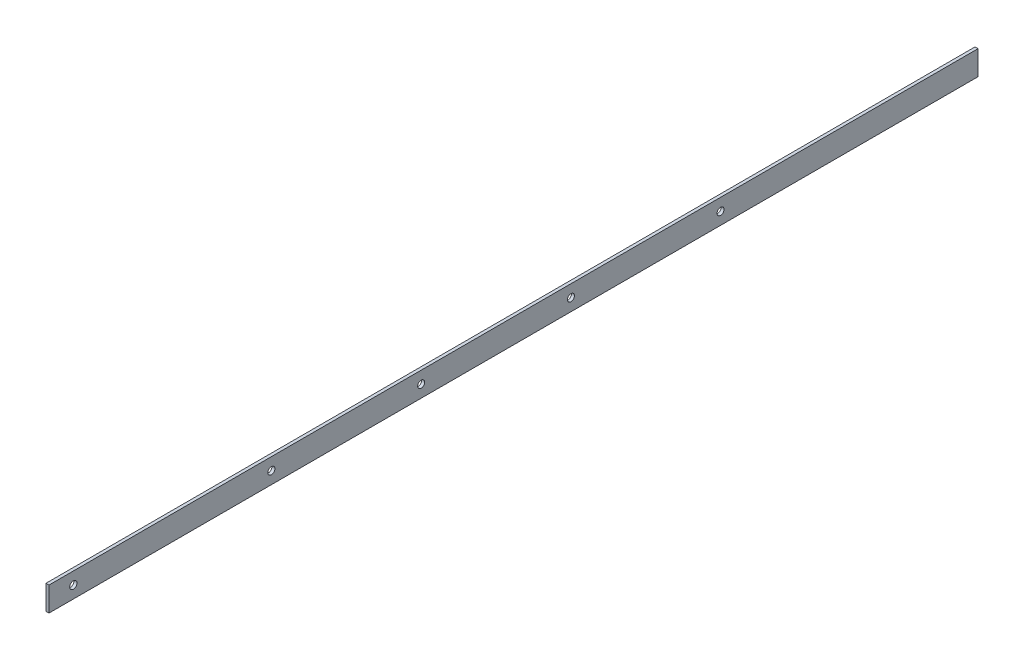
ISO-10303-21;
HEADER;
FILE_DESCRIPTION(('STEP AP214'),'2;1');
FILE_NAME('part.step','',(''),(''),'','','');
FILE_SCHEMA(('AUTOMOTIVE_DESIGN { 1 0 10303 214 1 1 1 1 }'));
ENDSEC;
DATA;
#1=APPLICATION_CONTEXT('core data for automotive mechanical design processes');
#2=APPLICATION_PROTOCOL_DEFINITION('international standard','automotive_design',2000,#1);
#3=PRODUCT_CONTEXT('',#1,'mechanical');
#4=PRODUCT('Part','Part','',(#3));
#5=PRODUCT_RELATED_PRODUCT_CATEGORY('part','',(#4));
#6=PRODUCT_DEFINITION_FORMATION('','',#4);
#7=PRODUCT_DEFINITION_CONTEXT('part definition',#1,'design');
#8=PRODUCT_DEFINITION('design','',#6,#7);
#9=PRODUCT_DEFINITION_SHAPE('','',#8);
#10=(LENGTH_UNIT() NAMED_UNIT(*) SI_UNIT(.MILLI.,.METRE.));
#11=(NAMED_UNIT(*) PLANE_ANGLE_UNIT() SI_UNIT($,.RADIAN.));
#12=(NAMED_UNIT(*) SI_UNIT($,.STERADIAN.) SOLID_ANGLE_UNIT());
#13=UNCERTAINTY_MEASURE_WITH_UNIT(LENGTH_MEASURE(1.E-05),#10,'distance_accuracy_value','');
#14=(GEOMETRIC_REPRESENTATION_CONTEXT(3) GLOBAL_UNCERTAINTY_ASSIGNED_CONTEXT((#13)) GLOBAL_UNIT_ASSIGNED_CONTEXT((#10,
#11,#12)) REPRESENTATION_CONTEXT('',''));
#15=CARTESIAN_POINT('',(0.,0.,0.));
#16=DIRECTION('',(0.,0.,1.));
#17=DIRECTION('',(1.,0.,0.));
#18=AXIS2_PLACEMENT_3D('',#15,#16,#17);
#19=CARTESIAN_POINT('',(0.,0.,485.14));
#20=DIRECTION('',(1.,0.,0.));
#21=DIRECTION('',(0.,1.,0.));
#22=AXIS2_PLACEMENT_3D('',#19,#20,#21);
#23=PLANE('',#22);
#24=CARTESIAN_POINT('',(0.,6.35000000000008,369.033439454375));
#25=DIRECTION('',(1.,0.,0.));
#26=DIRECTION('',(0.,0.,-1.));
#27=AXIS2_PLACEMENT_3D('',#24,#25,#26);
#28=CIRCLE('',#27,1.82879999999999);
#29=CARTESIAN_POINT('',(0.,6.35000000000008,367.204639454375));
#30=VERTEX_POINT('',#29);
#31=EDGE_CURVE('E164',#30,#30,#28,.T.);
#32=ORIENTED_EDGE('',*,*,#31,.T.);
#33=EDGE_LOOP('',(#32));
#34=FACE_BOUND('',#33,.T.);
#35=CARTESIAN_POINT('',(0.,6.35000000000008,290.801439454375));
#36=DIRECTION('',(1.,0.,0.));
#37=DIRECTION('',(0.,0.,-1.));
#38=AXIS2_PLACEMENT_3D('',#35,#36,#37);
#39=CIRCLE('',#38,1.82879999999999);
#40=CARTESIAN_POINT('',(0.,6.35000000000008,288.972639454375));
#41=VERTEX_POINT('',#40);
#42=EDGE_CURVE('E122',#41,#41,#39,.T.);
#43=ORIENTED_EDGE('',*,*,#42,.T.);
#44=EDGE_LOOP('',(#43));
#45=FACE_BOUND('',#44,.T.);
#46=CARTESIAN_POINT('',(0.,6.35000000000008,212.569439454375));
#47=DIRECTION('',(1.,0.,0.));
#48=DIRECTION('',(0.,0.,-1.));
#49=AXIS2_PLACEMENT_3D('',#46,#47,#48);
#50=CIRCLE('',#49,1.82879999999999);
#51=CARTESIAN_POINT('',(0.,6.35000000000008,210.740639454375));
#52=VERTEX_POINT('',#51);
#53=EDGE_CURVE('E110',#52,#52,#50,.T.);
#54=ORIENTED_EDGE('',*,*,#53,.T.);
#55=EDGE_LOOP('',(#54));
#56=FACE_BOUND('',#55,.T.);
#57=CARTESIAN_POINT('',(0.,6.35000000000008,134.430638313341));
#58=DIRECTION('',(1.,0.,0.));
#59=DIRECTION('',(0.,0.,-1.));
#60=AXIS2_PLACEMENT_3D('',#57,#58,#59);
#61=CIRCLE('',#60,1.82879999999999);
#62=CARTESIAN_POINT('',(0.,6.35000000000008,132.601838313341));
#63=VERTEX_POINT('',#62);
#64=EDGE_CURVE('E109',#63,#63,#61,.T.);
#65=ORIENTED_EDGE('',*,*,#64,.T.);
#66=EDGE_LOOP('',(#65));
#67=FACE_BOUND('',#66,.T.);
#68=CARTESIAN_POINT('',(0.,6.35,472.44));
#69=DIRECTION('',(1.,0.,0.));
#70=DIRECTION('',(0.,0.,-1.));
#71=AXIS2_PLACEMENT_3D('',#68,#69,#70);
#72=CIRCLE('',#71,1.89865);
#73=CARTESIAN_POINT('',(0.,6.35,470.54135));
#74=VERTEX_POINT('',#73);
#75=EDGE_CURVE('E102',#74,#74,#72,.T.);
#76=ORIENTED_EDGE('',*,*,#75,.T.);
#77=EDGE_LOOP('',(#76));
#78=FACE_BOUND('',#77,.T.);
#79=DIRECTION('',(0.,-1.,0.));
#80=VECTOR('',#79,1.);
#81=CARTESIAN_POINT('',(0.,0.,0.));
#82=LINE('',#81,#80);
#83=CARTESIAN_POINT('',(0.,12.7,0.));
#84=VERTEX_POINT('',#83);
#85=CARTESIAN_POINT('',(0.,0.,0.));
#86=VERTEX_POINT('',#85);
#87=EDGE_CURVE('E99',#84,#86,#82,.T.);
#88=ORIENTED_EDGE('',*,*,#87,.T.);
#89=DIRECTION('',(0.,0.,-1.));
#90=VECTOR('',#89,1.);
#91=CARTESIAN_POINT('',(0.,0.,485.14));
#92=LINE('',#91,#90);
#93=CARTESIAN_POINT('',(0.,0.,485.14));
#94=VERTEX_POINT('',#93);
#95=EDGE_CURVE('E11',#94,#86,#92,.T.);
#96=ORIENTED_EDGE('',*,*,#95,.F.);
#97=DIRECTION('',(0.,-1.,0.));
#98=VECTOR('',#97,1.);
#99=CARTESIAN_POINT('',(0.,0.,485.14));
#100=LINE('',#99,#98);
#101=CARTESIAN_POINT('',(0.,12.7,485.14));
#102=VERTEX_POINT('',#101);
#103=EDGE_CURVE('E86',#102,#94,#100,.T.);
#104=ORIENTED_EDGE('',*,*,#103,.F.);
#105=DIRECTION('',(0.,0.,-1.));
#106=VECTOR('',#105,1.);
#107=CARTESIAN_POINT('',(0.,12.7,485.14));
#108=LINE('',#107,#106);
#109=EDGE_CURVE('E95',#102,#84,#108,.T.);
#110=ORIENTED_EDGE('',*,*,#109,.T.);
#111=EDGE_LOOP('',(#88,#96,#104,#110));
#112=FACE_BOUND('',#111,.T.);
#113=ADVANCED_FACE('F33',(#34,#45,#56,#67,#78,#112),#23,.F.);
#114=CARTESIAN_POINT('',(0.,0.,485.14));
#115=DIRECTION('',(0.,1.,0.));
#116=DIRECTION('',(0.,0.,1.));
#117=AXIS2_PLACEMENT_3D('',#114,#115,#116);
#118=PLANE('',#117);
#119=DIRECTION('',(1.,0.,0.));
#120=VECTOR('',#119,1.);
#121=CARTESIAN_POINT('',(0.,0.,0.));
#122=LINE('',#121,#120);
#123=CARTESIAN_POINT('',(1.5875,0.,0.));
#124=VERTEX_POINT('',#123);
#125=EDGE_CURVE('E90',#86,#124,#122,.T.);
#126=ORIENTED_EDGE('',*,*,#125,.T.);
#127=DIRECTION('',(0.,0.,-1.));
#128=VECTOR('',#127,1.);
#129=CARTESIAN_POINT('',(1.5875,0.,485.14));
#130=LINE('',#129,#128);
#131=CARTESIAN_POINT('',(1.5875,0.,485.14));
#132=VERTEX_POINT('',#131);
#133=EDGE_CURVE('E42',#132,#124,#130,.T.);
#134=ORIENTED_EDGE('',*,*,#133,.F.);
#135=DIRECTION('',(1.,0.,0.));
#136=VECTOR('',#135,1.);
#137=CARTESIAN_POINT('',(0.,0.,485.14));
#138=LINE('',#137,#136);
#139=EDGE_CURVE('E81',#94,#132,#138,.T.);
#140=ORIENTED_EDGE('',*,*,#139,.F.);
#141=ORIENTED_EDGE('',*,*,#95,.T.);
#142=EDGE_LOOP('',(#126,#134,#140,#141));
#143=FACE_BOUND('',#142,.T.);
#144=ADVANCED_FACE('F89',(#143),#118,.F.);
#145=CARTESIAN_POINT('',(1.5875,0.,485.14));
#146=DIRECTION('',(-1.,0.,0.));
#147=DIRECTION('',(0.,-1.,0.));
#148=AXIS2_PLACEMENT_3D('',#145,#146,#147);
#149=PLANE('',#148);
#150=CARTESIAN_POINT('',(1.5875,6.35000000000008,369.033439454375));
#151=DIRECTION('',(-1.,0.,0.));
#152=DIRECTION('',(0.,-1.,0.));
#153=AXIS2_PLACEMENT_3D('',#150,#151,#152);
#154=CIRCLE('',#153,1.82879999999999);
#155=CARTESIAN_POINT('',(1.5875,4.52120000000009,369.033439454375));
#156=VERTEX_POINT('',#155);
#157=EDGE_CURVE('E36',#156,#156,#154,.T.);
#158=ORIENTED_EDGE('',*,*,#157,.T.);
#159=EDGE_LOOP('',(#158));
#160=FACE_BOUND('',#159,.T.);
#161=CARTESIAN_POINT('',(1.5875,6.35000000000008,290.801439454375));
#162=DIRECTION('',(-1.,0.,0.));
#163=DIRECTION('',(0.,-1.,0.));
#164=AXIS2_PLACEMENT_3D('',#161,#162,#163);
#165=CIRCLE('',#164,1.82879999999999);
#166=CARTESIAN_POINT('',(1.5875,4.52120000000009,290.801439454375));
#167=VERTEX_POINT('',#166);
#168=EDGE_CURVE('E117',#167,#167,#165,.T.);
#169=ORIENTED_EDGE('',*,*,#168,.T.);
#170=EDGE_LOOP('',(#169));
#171=FACE_BOUND('',#170,.T.);
#172=CARTESIAN_POINT('',(1.5875,6.35000000000008,212.569439454375));
#173=DIRECTION('',(-1.,0.,0.));
#174=DIRECTION('',(0.,-1.,0.));
#175=AXIS2_PLACEMENT_3D('',#172,#173,#174);
#176=CIRCLE('',#175,1.82879999999999);
#177=CARTESIAN_POINT('',(1.5875,4.52120000000009,212.569439454375));
#178=VERTEX_POINT('',#177);
#179=EDGE_CURVE('E107',#178,#178,#176,.T.);
#180=ORIENTED_EDGE('',*,*,#179,.T.);
#181=EDGE_LOOP('',(#180));
#182=FACE_BOUND('',#181,.T.);
#183=CARTESIAN_POINT('',(1.5875,6.35000000000008,134.430638313341));
#184=DIRECTION('',(-1.,0.,0.));
#185=DIRECTION('',(0.,-1.,0.));
#186=AXIS2_PLACEMENT_3D('',#183,#184,#185);
#187=CIRCLE('',#186,1.82879999999999);
#188=CARTESIAN_POINT('',(1.5875,4.52120000000009,134.430638313341));
#189=VERTEX_POINT('',#188);
#190=EDGE_CURVE('E114',#189,#189,#187,.T.);
#191=ORIENTED_EDGE('',*,*,#190,.T.);
#192=EDGE_LOOP('',(#191));
#193=FACE_BOUND('',#192,.T.);
#194=CARTESIAN_POINT('',(1.5875,6.35,472.44));
#195=DIRECTION('',(1.,0.,0.));
#196=DIRECTION('',(0.,0.,-1.));
#197=AXIS2_PLACEMENT_3D('',#194,#195,#196);
#198=CIRCLE('',#197,1.89865);
#199=CARTESIAN_POINT('',(1.5875,6.35,470.54135));
#200=VERTEX_POINT('',#199);
#201=EDGE_CURVE('E128',#200,#200,#198,.T.);
#202=ORIENTED_EDGE('',*,*,#201,.F.);
#203=EDGE_LOOP('',(#202));
#204=FACE_BOUND('',#203,.T.);
#205=DIRECTION('',(0.,1.,0.));
#206=VECTOR('',#205,1.);
#207=CARTESIAN_POINT('',(1.5875,0.,0.));
#208=LINE('',#207,#206);
#209=CARTESIAN_POINT('',(1.5875,12.7,0.));
#210=VERTEX_POINT('',#209);
#211=EDGE_CURVE('E68',#124,#210,#208,.T.);
#212=ORIENTED_EDGE('',*,*,#211,.T.);
#213=DIRECTION('',(0.,0.,-1.));
#214=VECTOR('',#213,1.);
#215=CARTESIAN_POINT('',(1.5875,12.7,485.14));
#216=LINE('',#215,#214);
#217=CARTESIAN_POINT('',(1.5875,12.7,485.14));
#218=VERTEX_POINT('',#217);
#219=EDGE_CURVE('E91',#218,#210,#216,.T.);
#220=ORIENTED_EDGE('',*,*,#219,.F.);
#221=DIRECTION('',(0.,1.,0.));
#222=VECTOR('',#221,1.);
#223=CARTESIAN_POINT('',(1.5875,0.,485.14));
#224=LINE('',#223,#222);
#225=EDGE_CURVE('E84',#132,#218,#224,.T.);
#226=ORIENTED_EDGE('',*,*,#225,.F.);
#227=ORIENTED_EDGE('',*,*,#133,.T.);
#228=EDGE_LOOP('',(#212,#220,#226,#227));
#229=FACE_BOUND('',#228,.T.);
#230=ADVANCED_FACE('F93',(#160,#171,#182,#193,#204,#229),#149,.F.);
#231=CARTESIAN_POINT('',(0.,12.7,485.14));
#232=DIRECTION('',(0.,-1.,0.));
#233=DIRECTION('',(0.,0.,-1.));
#234=AXIS2_PLACEMENT_3D('',#231,#232,#233);
#235=PLANE('',#234);
#236=DIRECTION('',(-1.,0.,0.));
#237=VECTOR('',#236,1.);
#238=CARTESIAN_POINT('',(0.,12.7,0.));
#239=LINE('',#238,#237);
#240=EDGE_CURVE('E74',#210,#84,#239,.T.);
#241=ORIENTED_EDGE('',*,*,#240,.T.);
#242=ORIENTED_EDGE('',*,*,#109,.F.);
#243=DIRECTION('',(-1.,0.,0.));
#244=VECTOR('',#243,1.);
#245=CARTESIAN_POINT('',(0.,12.7,485.14));
#246=LINE('',#245,#244);
#247=EDGE_CURVE('E51',#218,#102,#246,.T.);
#248=ORIENTED_EDGE('',*,*,#247,.F.);
#249=ORIENTED_EDGE('',*,*,#219,.T.);
#250=EDGE_LOOP('',(#241,#242,#248,#249));
#251=FACE_BOUND('',#250,.T.);
#252=ADVANCED_FACE('F145',(#251),#235,.F.);
#253=CARTESIAN_POINT('',(0.,0.,485.14));
#254=DIRECTION('',(0.,0.,-1.));
#255=DIRECTION('',(-1.,0.,0.));
#256=AXIS2_PLACEMENT_3D('',#253,#254,#255);
#257=PLANE('',#256);
#258=ORIENTED_EDGE('',*,*,#103,.T.);
#259=ORIENTED_EDGE('',*,*,#139,.T.);
#260=ORIENTED_EDGE('',*,*,#225,.T.);
#261=ORIENTED_EDGE('',*,*,#247,.T.);
#262=EDGE_LOOP('',(#258,#259,#260,#261));
#263=FACE_BOUND('',#262,.T.);
#264=ADVANCED_FACE('F82',(#263),#257,.F.);
#265=CARTESIAN_POINT('',(0.,0.,0.));
#266=DIRECTION('',(0.,0.,-1.));
#267=DIRECTION('',(-1.,0.,0.));
#268=AXIS2_PLACEMENT_3D('',#265,#266,#267);
#269=PLANE('',#268);
#270=ORIENTED_EDGE('',*,*,#87,.F.);
#271=ORIENTED_EDGE('',*,*,#240,.F.);
#272=ORIENTED_EDGE('',*,*,#211,.F.);
#273=ORIENTED_EDGE('',*,*,#125,.F.);
#274=EDGE_LOOP('',(#270,#271,#272,#273));
#275=FACE_BOUND('',#274,.T.);
#276=ADVANCED_FACE('F140',(#275),#269,.T.);
#277=CARTESIAN_POINT('',(1.5875,6.35,472.44));
#278=DIRECTION('',(1.,0.,0.));
#279=DIRECTION('',(0.,0.,-1.));
#280=AXIS2_PLACEMENT_3D('',#277,#278,#279);
#281=CYLINDRICAL_SURFACE('',#280,1.89865);
#282=ORIENTED_EDGE('',*,*,#75,.F.);
#283=EDGE_LOOP('',(#282));
#284=FACE_BOUND('',#283,.T.);
#285=ORIENTED_EDGE('',*,*,#201,.T.);
#286=EDGE_LOOP('',(#285));
#287=FACE_BOUND('',#286,.T.);
#288=ADVANCED_FACE('F136',(#284,#287),#281,.F.);
#289=CARTESIAN_POINT('',(7.14374999999988,6.35000000000008,134.430638313341));
#290=DIRECTION('',(1.,0.,0.));
#291=DIRECTION('',(0.,0.,-1.));
#292=AXIS2_PLACEMENT_3D('',#289,#290,#291);
#293=CYLINDRICAL_SURFACE('',#292,1.82879999999999);
#294=ORIENTED_EDGE('',*,*,#64,.F.);
#295=EDGE_LOOP('',(#294));
#296=FACE_BOUND('',#295,.T.);
#297=ORIENTED_EDGE('',*,*,#190,.F.);
#298=EDGE_LOOP('',(#297));
#299=FACE_BOUND('',#298,.T.);
#300=ADVANCED_FACE('F139',(#296,#299),#293,.F.);
#301=CARTESIAN_POINT('',(7.14374999999988,6.35000000000008,212.569439454375));
#302=DIRECTION('',(1.,0.,0.));
#303=DIRECTION('',(0.,0.,-1.));
#304=AXIS2_PLACEMENT_3D('',#301,#302,#303);
#305=CYLINDRICAL_SURFACE('',#304,1.82879999999999);
#306=ORIENTED_EDGE('',*,*,#53,.F.);
#307=EDGE_LOOP('',(#306));
#308=FACE_BOUND('',#307,.T.);
#309=ORIENTED_EDGE('',*,*,#179,.F.);
#310=EDGE_LOOP('',(#309));
#311=FACE_BOUND('',#310,.T.);
#312=ADVANCED_FACE('F172',(#308,#311),#305,.F.);
#313=CARTESIAN_POINT('',(7.14374999999988,6.35000000000008,290.801439454375));
#314=DIRECTION('',(1.,0.,0.));
#315=DIRECTION('',(0.,0.,-1.));
#316=AXIS2_PLACEMENT_3D('',#313,#314,#315);
#317=CYLINDRICAL_SURFACE('',#316,1.82879999999999);
#318=ORIENTED_EDGE('',*,*,#42,.F.);
#319=EDGE_LOOP('',(#318));
#320=FACE_BOUND('',#319,.T.);
#321=ORIENTED_EDGE('',*,*,#168,.F.);
#322=EDGE_LOOP('',(#321));
#323=FACE_BOUND('',#322,.T.);
#324=ADVANCED_FACE('F178',(#320,#323),#317,.F.);
#325=CARTESIAN_POINT('',(7.14374999999988,6.35000000000008,369.033439454375));
#326=DIRECTION('',(1.,0.,0.));
#327=DIRECTION('',(0.,0.,-1.));
#328=AXIS2_PLACEMENT_3D('',#325,#326,#327);
#329=CYLINDRICAL_SURFACE('',#328,1.82879999999999);
#330=ORIENTED_EDGE('',*,*,#31,.F.);
#331=EDGE_LOOP('',(#330));
#332=FACE_BOUND('',#331,.T.);
#333=ORIENTED_EDGE('',*,*,#157,.F.);
#334=EDGE_LOOP('',(#333));
#335=FACE_BOUND('',#334,.T.);
#336=ADVANCED_FACE('F217',(#332,#335),#329,.F.);
#337=CLOSED_SHELL('',(#113,#144,#230,#252,#264,#276,#288,#300,#312,#324,#336));
#338=MANIFOLD_SOLID_BREP('B2',#337);
#339=ADVANCED_BREP_SHAPE_REPRESENTATION('',(#18,#338),#14);
#340=SHAPE_DEFINITION_REPRESENTATION(#9,#339);
ENDSEC;
END-ISO-10303-21;
